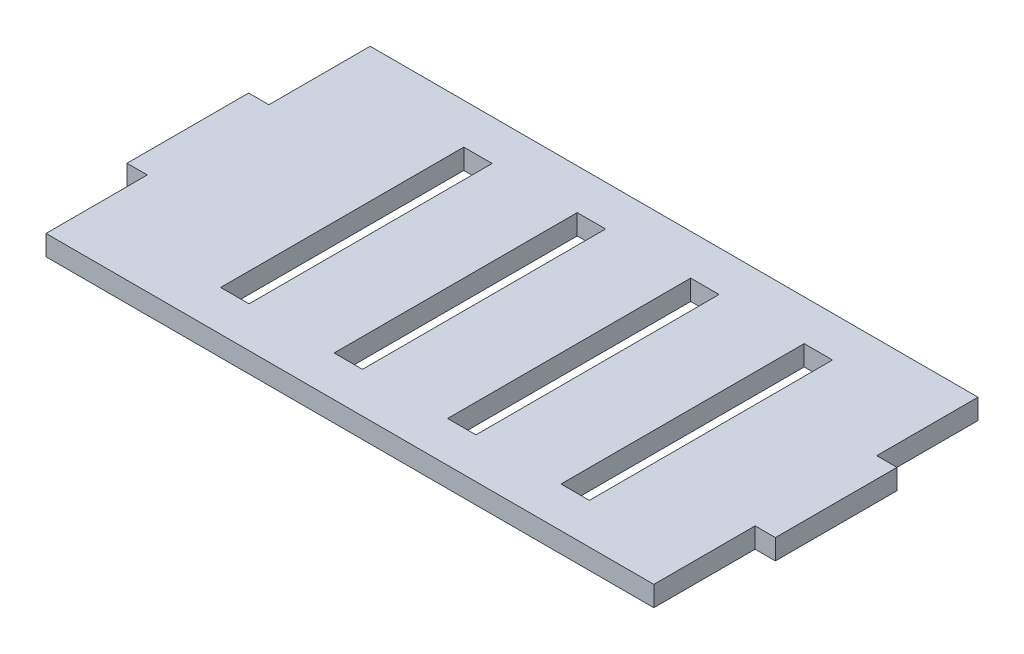
ISO-10303-21;
HEADER;
FILE_DESCRIPTION(('STEP AP214'),'2;1');
FILE_NAME('part.step','',(''),(''),'','','');
FILE_SCHEMA(('AUTOMOTIVE_DESIGN { 1 0 10303 214 1 1 1 1 }'));
ENDSEC;
DATA;
#1=APPLICATION_CONTEXT('core data for automotive mechanical design processes');
#2=APPLICATION_PROTOCOL_DEFINITION('international standard','automotive_design',2000,#1);
#3=PRODUCT_CONTEXT('',#1,'mechanical');
#4=PRODUCT('Part','Part','',(#3));
#5=PRODUCT_RELATED_PRODUCT_CATEGORY('part','',(#4));
#6=PRODUCT_DEFINITION_FORMATION('','',#4);
#7=PRODUCT_DEFINITION_CONTEXT('part definition',#1,'design');
#8=PRODUCT_DEFINITION('design','',#6,#7);
#9=PRODUCT_DEFINITION_SHAPE('','',#8);
#10=(LENGTH_UNIT() NAMED_UNIT(*) SI_UNIT(.MILLI.,.METRE.));
#11=(NAMED_UNIT(*) PLANE_ANGLE_UNIT() SI_UNIT($,.RADIAN.));
#12=(NAMED_UNIT(*) SI_UNIT($,.STERADIAN.) SOLID_ANGLE_UNIT());
#13=UNCERTAINTY_MEASURE_WITH_UNIT(LENGTH_MEASURE(1.E-05),#10,'distance_accuracy_value','');
#14=(GEOMETRIC_REPRESENTATION_CONTEXT(3) GLOBAL_UNCERTAINTY_ASSIGNED_CONTEXT((#13)) GLOBAL_UNIT_ASSIGNED_CONTEXT((#10,
#11,#12)) REPRESENTATION_CONTEXT('',''));
#15=CARTESIAN_POINT('',(0.,0.,0.));
#16=DIRECTION('',(0.,0.,1.));
#17=DIRECTION('',(1.,0.,0.));
#18=AXIS2_PLACEMENT_3D('',#15,#16,#17);
#19=CARTESIAN_POINT('',(95.2499999999999,6.35,50.8));
#20=DIRECTION('',(-1.,0.,0.));
#21=DIRECTION('',(0.,0.,1.));
#22=AXIS2_PLACEMENT_3D('',#19,#20,#21);
#23=PLANE('',#22);
#24=DIRECTION('',(0.,-1.,0.));
#25=VECTOR('',#24,1.);
#26=CARTESIAN_POINT('',(95.2499999999999,6.35,19.05));
#27=LINE('',#26,#25);
#28=CARTESIAN_POINT('',(95.2499999999999,6.35,19.05));
#29=VERTEX_POINT('',#28);
#30=CARTESIAN_POINT('',(95.2499999999999,0.,19.05));
#31=VERTEX_POINT('',#30);
#32=EDGE_CURVE('E49',#29,#31,#27,.T.);
#33=ORIENTED_EDGE('',*,*,#32,.F.);
#34=DIRECTION('',(0.,0.,-1.));
#35=VECTOR('',#34,1.);
#36=CARTESIAN_POINT('',(95.2499999999999,6.35,50.8));
#37=LINE('',#36,#35);
#38=CARTESIAN_POINT('',(95.2499999999999,6.35,50.8));
#39=VERTEX_POINT('',#38);
#40=EDGE_CURVE('E278',#39,#29,#37,.T.);
#41=ORIENTED_EDGE('',*,*,#40,.F.);
#42=DIRECTION('',(0.,-1.,0.));
#43=VECTOR('',#42,1.);
#44=CARTESIAN_POINT('',(95.2499999999999,6.35,50.8));
#45=LINE('',#44,#43);
#46=CARTESIAN_POINT('',(95.2499999999999,0.,50.8));
#47=VERTEX_POINT('',#46);
#48=EDGE_CURVE('E316',#39,#47,#45,.T.);
#49=ORIENTED_EDGE('',*,*,#48,.T.);
#50=DIRECTION('',(0.,0.,-1.));
#51=VECTOR('',#50,1.);
#52=CARTESIAN_POINT('',(95.2499999999999,0.,50.8));
#53=LINE('',#52,#51);
#54=EDGE_CURVE('E349',#47,#31,#53,.T.);
#55=ORIENTED_EDGE('',*,*,#54,.T.);
#56=EDGE_LOOP('',(#33,#41,#49,#55));
#57=FACE_BOUND('',#56,.T.);
#58=ADVANCED_FACE('F33',(#57),#23,.F.);
#59=DIRECTION('',(0.,1.,0.));
#60=VECTOR('',#59,1.);
#61=CARTESIAN_POINT('',(95.2499999999999,6.35,-19.05));
#62=LINE('',#61,#60);
#63=CARTESIAN_POINT('',(95.2499999999999,0.,-19.05));
#64=VERTEX_POINT('',#63);
#65=CARTESIAN_POINT('',(95.2499999999999,6.35,-19.05));
#66=VERTEX_POINT('',#65);
#67=EDGE_CURVE('E57',#64,#66,#62,.T.);
#68=ORIENTED_EDGE('',*,*,#67,.F.);
#69=CARTESIAN_POINT('',(95.2499999999999,0.,-50.8));
#70=VERTEX_POINT('',#69);
#71=EDGE_CURVE('E288',#64,#70,#53,.T.);
#72=ORIENTED_EDGE('',*,*,#71,.T.);
#73=DIRECTION('',(0.,-1.,0.));
#74=VECTOR('',#73,1.);
#75=CARTESIAN_POINT('',(95.2499999999999,6.35,-50.8));
#76=LINE('',#75,#74);
#77=CARTESIAN_POINT('',(95.2499999999999,6.35,-50.8));
#78=VERTEX_POINT('',#77);
#79=EDGE_CURVE('E11',#78,#70,#76,.T.);
#80=ORIENTED_EDGE('',*,*,#79,.F.);
#81=EDGE_CURVE('E267',#66,#78,#37,.T.);
#82=ORIENTED_EDGE('',*,*,#81,.F.);
#83=EDGE_LOOP('',(#68,#72,#80,#82));
#84=FACE_BOUND('',#83,.T.);
#85=ADVANCED_FACE('F348',(#84),#23,.F.);
#86=CARTESIAN_POINT('',(-95.2500000000001,6.35,50.8));
#87=DIRECTION('',(1.,0.,0.));
#88=DIRECTION('',(0.,0.,-1.));
#89=AXIS2_PLACEMENT_3D('',#86,#87,#88);
#90=PLANE('',#89);
#91=DIRECTION('',(0.,-1.,0.));
#92=VECTOR('',#91,1.);
#93=CARTESIAN_POINT('',(-95.2500000000001,6.35,-19.05));
#94=LINE('',#93,#92);
#95=CARTESIAN_POINT('',(-95.2500000000001,6.35,-19.05));
#96=VERTEX_POINT('',#95);
#97=CARTESIAN_POINT('',(-95.2500000000001,0.,-19.05));
#98=VERTEX_POINT('',#97);
#99=EDGE_CURVE('E242',#96,#98,#94,.T.);
#100=ORIENTED_EDGE('',*,*,#99,.F.);
#101=DIRECTION('',(0.,0.,1.));
#102=VECTOR('',#101,1.);
#103=CARTESIAN_POINT('',(-95.2500000000001,6.35,50.8));
#104=LINE('',#103,#102);
#105=CARTESIAN_POINT('',(-95.2500000000001,6.35,-50.8));
#106=VERTEX_POINT('',#105);
#107=EDGE_CURVE('E303',#106,#96,#104,.T.);
#108=ORIENTED_EDGE('',*,*,#107,.F.);
#109=DIRECTION('',(0.,-1.,0.));
#110=VECTOR('',#109,1.);
#111=CARTESIAN_POINT('',(-95.2500000000001,6.35,-50.8));
#112=LINE('',#111,#110);
#113=CARTESIAN_POINT('',(-95.2500000000001,0.,-50.8));
#114=VERTEX_POINT('',#113);
#115=EDGE_CURVE('E41',#106,#114,#112,.T.);
#116=ORIENTED_EDGE('',*,*,#115,.T.);
#117=DIRECTION('',(0.,0.,1.));
#118=VECTOR('',#117,1.);
#119=CARTESIAN_POINT('',(-95.2500000000001,0.,50.8));
#120=LINE('',#119,#118);
#121=EDGE_CURVE('E309',#114,#98,#120,.T.);
#122=ORIENTED_EDGE('',*,*,#121,.T.);
#123=EDGE_LOOP('',(#100,#108,#116,#122));
#124=FACE_BOUND('',#123,.T.);
#125=ADVANCED_FACE('F326',(#124),#90,.F.);
#126=DIRECTION('',(0.,1.,0.));
#127=VECTOR('',#126,1.);
#128=CARTESIAN_POINT('',(-95.2500000000001,6.35,19.05));
#129=LINE('',#128,#127);
#130=CARTESIAN_POINT('',(-95.2500000000001,0.,19.05));
#131=VERTEX_POINT('',#130);
#132=CARTESIAN_POINT('',(-95.2500000000001,6.35,19.05));
#133=VERTEX_POINT('',#132);
#134=EDGE_CURVE('E245',#131,#133,#129,.T.);
#135=ORIENTED_EDGE('',*,*,#134,.F.);
#136=CARTESIAN_POINT('',(-95.2500000000001,0.,50.8));
#137=VERTEX_POINT('',#136);
#138=EDGE_CURVE('E306',#131,#137,#120,.T.);
#139=ORIENTED_EDGE('',*,*,#138,.T.);
#140=DIRECTION('',(0.,-1.,0.));
#141=VECTOR('',#140,1.);
#142=CARTESIAN_POINT('',(-95.2500000000001,6.35,50.8));
#143=LINE('',#142,#141);
#144=CARTESIAN_POINT('',(-95.2500000000001,6.35,50.8));
#145=VERTEX_POINT('',#144);
#146=EDGE_CURVE('E318',#145,#137,#143,.T.);
#147=ORIENTED_EDGE('',*,*,#146,.F.);
#148=EDGE_CURVE('E284',#133,#145,#104,.T.);
#149=ORIENTED_EDGE('',*,*,#148,.F.);
#150=EDGE_LOOP('',(#135,#139,#147,#149));
#151=FACE_BOUND('',#150,.T.);
#152=ADVANCED_FACE('F531',(#151),#90,.F.);
#153=CARTESIAN_POINT('',(-95.2500000000001,6.35,-50.8));
#154=DIRECTION('',(0.,0.,1.));
#155=DIRECTION('',(1.,0.,0.));
#156=AXIS2_PLACEMENT_3D('',#153,#154,#155);
#157=PLANE('',#156);
#158=DIRECTION('',(-1.,0.,0.));
#159=VECTOR('',#158,1.);
#160=CARTESIAN_POINT('',(-95.2500000000001,0.,-50.8));
#161=LINE('',#160,#159);
#162=EDGE_CURVE('E310',#70,#114,#161,.T.);
#163=ORIENTED_EDGE('',*,*,#162,.T.);
#164=ORIENTED_EDGE('',*,*,#115,.F.);
#165=DIRECTION('',(-1.,0.,0.));
#166=VECTOR('',#165,1.);
#167=CARTESIAN_POINT('',(-95.2500000000001,6.35,-50.8));
#168=LINE('',#167,#166);
#169=EDGE_CURVE('E283',#78,#106,#168,.T.);
#170=ORIENTED_EDGE('',*,*,#169,.F.);
#171=ORIENTED_EDGE('',*,*,#79,.T.);
#172=EDGE_LOOP('',(#163,#164,#170,#171));
#173=FACE_BOUND('',#172,.T.);
#174=ADVANCED_FACE('F347',(#173),#157,.F.);
#175=CARTESIAN_POINT('',(-95.2500000000001,6.35,50.8));
#176=DIRECTION('',(0.,0.,-1.));
#177=DIRECTION('',(-1.,0.,0.));
#178=AXIS2_PLACEMENT_3D('',#175,#176,#177);
#179=PLANE('',#178);
#180=DIRECTION('',(1.,0.,0.));
#181=VECTOR('',#180,1.);
#182=CARTESIAN_POINT('',(-95.2500000000001,0.,50.8));
#183=LINE('',#182,#181);
#184=EDGE_CURVE('E286',#137,#47,#183,.T.);
#185=ORIENTED_EDGE('',*,*,#184,.T.);
#186=ORIENTED_EDGE('',*,*,#48,.F.);
#187=DIRECTION('',(1.,0.,0.));
#188=VECTOR('',#187,1.);
#189=CARTESIAN_POINT('',(-95.2500000000001,6.35,50.8));
#190=LINE('',#189,#188);
#191=EDGE_CURVE('E280',#145,#39,#190,.T.);
#192=ORIENTED_EDGE('',*,*,#191,.F.);
#193=ORIENTED_EDGE('',*,*,#146,.T.);
#194=EDGE_LOOP('',(#185,#186,#192,#193));
#195=FACE_BOUND('',#194,.T.);
#196=ADVANCED_FACE('F538',(#195),#179,.F.);
#197=CARTESIAN_POINT('',(0.,6.35,0.));
#198=DIRECTION('',(0.,-1.,0.));
#199=DIRECTION('',(0.,0.,-1.));
#200=AXIS2_PLACEMENT_3D('',#197,#198,#199);
#201=PLANE('',#200);
#202=DIRECTION('',(-1.,0.,0.));
#203=VECTOR('',#202,1.);
#204=CARTESIAN_POINT('',(53.4669999999999,6.35,-38.1));
#205=LINE('',#204,#203);
#206=CARTESIAN_POINT('',(62.3569999999999,6.35,-38.1));
#207=VERTEX_POINT('',#206);
#208=CARTESIAN_POINT('',(53.4669999999999,6.35,-38.1));
#209=VERTEX_POINT('',#208);
#210=EDGE_CURVE('E474',#207,#209,#205,.T.);
#211=ORIENTED_EDGE('',*,*,#210,.F.);
#212=DIRECTION('',(0.,0.,-1.));
#213=VECTOR('',#212,1.);
#214=CARTESIAN_POINT('',(62.3569999999999,6.35,-38.1));
#215=LINE('',#214,#213);
#216=CARTESIAN_POINT('',(62.3569999999999,6.35,38.1));
#217=VERTEX_POINT('',#216);
#218=EDGE_CURVE('E338',#217,#207,#215,.T.);
#219=ORIENTED_EDGE('',*,*,#218,.F.);
#220=DIRECTION('',(1.,0.,0.));
#221=VECTOR('',#220,1.);
#222=CARTESIAN_POINT('',(53.4669999999999,6.35,38.1));
#223=LINE('',#222,#221);
#224=CARTESIAN_POINT('',(53.4669999999999,6.35,38.1));
#225=VERTEX_POINT('',#224);
#226=EDGE_CURVE('E467',#225,#217,#223,.T.);
#227=ORIENTED_EDGE('',*,*,#226,.F.);
#228=DIRECTION('',(0.,0.,1.));
#229=VECTOR('',#228,1.);
#230=CARTESIAN_POINT('',(53.4669999999999,6.35,-38.1));
#231=LINE('',#230,#229);
#232=EDGE_CURVE('E471',#209,#225,#231,.T.);
#233=ORIENTED_EDGE('',*,*,#232,.F.);
#234=EDGE_LOOP('',(#211,#219,#227,#233));
#235=FACE_BOUND('',#234,.T.);
#236=DIRECTION('',(-1.,0.,0.));
#237=VECTOR('',#236,1.);
#238=CARTESIAN_POINT('',(17.9069999999999,6.35,-38.1));
#239=LINE('',#238,#237);
#240=CARTESIAN_POINT('',(26.7969999999999,6.35,-38.1));
#241=VERTEX_POINT('',#240);
#242=CARTESIAN_POINT('',(17.9069999999999,6.35,-38.1));
#243=VERTEX_POINT('',#242);
#244=EDGE_CURVE('E442',#241,#243,#239,.T.);
#245=ORIENTED_EDGE('',*,*,#244,.F.);
#246=DIRECTION('',(0.,0.,-1.));
#247=VECTOR('',#246,1.);
#248=CARTESIAN_POINT('',(26.7969999999999,6.35,-38.1));
#249=LINE('',#248,#247);
#250=CARTESIAN_POINT('',(26.7969999999999,6.35,38.1));
#251=VERTEX_POINT('',#250);
#252=EDGE_CURVE('E445',#251,#241,#249,.T.);
#253=ORIENTED_EDGE('',*,*,#252,.F.);
#254=DIRECTION('',(1.,0.,0.));
#255=VECTOR('',#254,1.);
#256=CARTESIAN_POINT('',(17.9069999999999,6.35,38.1));
#257=LINE('',#256,#255);
#258=CARTESIAN_POINT('',(17.9069999999999,6.35,38.1));
#259=VERTEX_POINT('',#258);
#260=EDGE_CURVE('E435',#259,#251,#257,.T.);
#261=ORIENTED_EDGE('',*,*,#260,.F.);
#262=DIRECTION('',(0.,0.,1.));
#263=VECTOR('',#262,1.);
#264=CARTESIAN_POINT('',(17.9069999999999,6.35,-38.1));
#265=LINE('',#264,#263);
#266=EDGE_CURVE('E439',#243,#259,#265,.T.);
#267=ORIENTED_EDGE('',*,*,#266,.F.);
#268=EDGE_LOOP('',(#245,#253,#261,#267));
#269=FACE_BOUND('',#268,.T.);
#270=DIRECTION('',(-1.,0.,0.));
#271=VECTOR('',#270,1.);
#272=CARTESIAN_POINT('',(-17.6530000000001,6.35,-38.1));
#273=LINE('',#272,#271);
#274=CARTESIAN_POINT('',(-8.76300000000006,6.35,-38.1));
#275=VERTEX_POINT('',#274);
#276=CARTESIAN_POINT('',(-17.6530000000001,6.35,-38.1));
#277=VERTEX_POINT('',#276);
#278=EDGE_CURVE('E410',#275,#277,#273,.T.);
#279=ORIENTED_EDGE('',*,*,#278,.F.);
#280=DIRECTION('',(0.,0.,-1.));
#281=VECTOR('',#280,1.);
#282=CARTESIAN_POINT('',(-8.76300000000006,6.35,-38.1));
#283=LINE('',#282,#281);
#284=CARTESIAN_POINT('',(-8.76300000000005,6.35,38.1));
#285=VERTEX_POINT('',#284);
#286=EDGE_CURVE('E413',#285,#275,#283,.T.);
#287=ORIENTED_EDGE('',*,*,#286,.F.);
#288=DIRECTION('',(1.,0.,0.));
#289=VECTOR('',#288,1.);
#290=CARTESIAN_POINT('',(-17.6530000000001,6.35,38.1));
#291=LINE('',#290,#289);
#292=CARTESIAN_POINT('',(-17.6530000000001,6.35,38.1));
#293=VERTEX_POINT('',#292);
#294=EDGE_CURVE('E403',#293,#285,#291,.T.);
#295=ORIENTED_EDGE('',*,*,#294,.F.);
#296=DIRECTION('',(0.,0.,1.));
#297=VECTOR('',#296,1.);
#298=CARTESIAN_POINT('',(-17.6530000000001,6.35,-38.1));
#299=LINE('',#298,#297);
#300=EDGE_CURVE('E407',#277,#293,#299,.T.);
#301=ORIENTED_EDGE('',*,*,#300,.F.);
#302=EDGE_LOOP('',(#279,#287,#295,#301));
#303=FACE_BOUND('',#302,.T.);
#304=DIRECTION('',(-1.,0.,0.));
#305=VECTOR('',#304,1.);
#306=CARTESIAN_POINT('',(-53.2130000000001,6.35,-38.1));
#307=LINE('',#306,#305);
#308=CARTESIAN_POINT('',(-44.3230000000001,6.35,-38.1));
#309=VERTEX_POINT('',#308);
#310=CARTESIAN_POINT('',(-53.2130000000001,6.35,-38.1));
#311=VERTEX_POINT('',#310);
#312=EDGE_CURVE('E383',#309,#311,#307,.T.);
#313=ORIENTED_EDGE('',*,*,#312,.F.);
#314=DIRECTION('',(0.,0.,-1.));
#315=VECTOR('',#314,1.);
#316=CARTESIAN_POINT('',(-44.3230000000001,6.35,-38.1));
#317=LINE('',#316,#315);
#318=CARTESIAN_POINT('',(-44.3230000000001,6.35,38.1));
#319=VERTEX_POINT('',#318);
#320=EDGE_CURVE('E381',#319,#309,#317,.T.);
#321=ORIENTED_EDGE('',*,*,#320,.F.);
#322=DIRECTION('',(1.,0.,0.));
#323=VECTOR('',#322,1.);
#324=CARTESIAN_POINT('',(-53.2130000000001,6.35,38.1));
#325=LINE('',#324,#323);
#326=CARTESIAN_POINT('',(-53.2130000000001,6.35,38.1));
#327=VERTEX_POINT('',#326);
#328=EDGE_CURVE('E359',#327,#319,#325,.T.);
#329=ORIENTED_EDGE('',*,*,#328,.F.);
#330=DIRECTION('',(0.,0.,1.));
#331=VECTOR('',#330,1.);
#332=CARTESIAN_POINT('',(-53.2130000000001,6.35,-38.1));
#333=LINE('',#332,#331);
#334=EDGE_CURVE('E385',#311,#327,#333,.T.);
#335=ORIENTED_EDGE('',*,*,#334,.F.);
#336=EDGE_LOOP('',(#313,#321,#329,#335));
#337=FACE_BOUND('',#336,.T.);
#338=ORIENTED_EDGE('',*,*,#40,.T.);
#339=DIRECTION('',(-1.,0.,0.));
#340=VECTOR('',#339,1.);
#341=CARTESIAN_POINT('',(101.6,6.35,19.05));
#342=LINE('',#341,#340);
#343=CARTESIAN_POINT('',(101.6,6.35,19.05));
#344=VERTEX_POINT('',#343);
#345=EDGE_CURVE('E255',#344,#29,#342,.T.);
#346=ORIENTED_EDGE('',*,*,#345,.F.);
#347=DIRECTION('',(0.,0.,1.));
#348=VECTOR('',#347,1.);
#349=CARTESIAN_POINT('',(101.6,6.35,19.05));
#350=LINE('',#349,#348);
#351=CARTESIAN_POINT('',(101.6,6.35,-19.05));
#352=VERTEX_POINT('',#351);
#353=EDGE_CURVE('E236',#352,#344,#350,.T.);
#354=ORIENTED_EDGE('',*,*,#353,.F.);
#355=DIRECTION('',(-1.,0.,0.));
#356=VECTOR('',#355,1.);
#357=CARTESIAN_POINT('',(101.6,6.35,-19.05));
#358=LINE('',#357,#356);
#359=EDGE_CURVE('E247',#352,#66,#358,.T.);
#360=ORIENTED_EDGE('',*,*,#359,.T.);
#361=ORIENTED_EDGE('',*,*,#81,.T.);
#362=ORIENTED_EDGE('',*,*,#169,.T.);
#363=ORIENTED_EDGE('',*,*,#107,.T.);
#364=DIRECTION('',(1.,0.,0.));
#365=VECTOR('',#364,1.);
#366=CARTESIAN_POINT('',(-101.6,6.35,-19.05));
#367=LINE('',#366,#365);
#368=CARTESIAN_POINT('',(-101.6,6.35,-19.05));
#369=VERTEX_POINT('',#368);
#370=EDGE_CURVE('E344',#369,#96,#367,.T.);
#371=ORIENTED_EDGE('',*,*,#370,.F.);
#372=DIRECTION('',(0.,0.,-1.));
#373=VECTOR('',#372,1.);
#374=CARTESIAN_POINT('',(-101.6,6.35,-19.05));
#375=LINE('',#374,#373);
#376=CARTESIAN_POINT('',(-101.6,6.35,19.05));
#377=VERTEX_POINT('',#376);
#378=EDGE_CURVE('E506',#377,#369,#375,.T.);
#379=ORIENTED_EDGE('',*,*,#378,.F.);
#380=DIRECTION('',(1.,0.,0.));
#381=VECTOR('',#380,1.);
#382=CARTESIAN_POINT('',(-101.6,6.35,19.05));
#383=LINE('',#382,#381);
#384=EDGE_CURVE('E494',#377,#133,#383,.T.);
#385=ORIENTED_EDGE('',*,*,#384,.T.);
#386=ORIENTED_EDGE('',*,*,#148,.T.);
#387=ORIENTED_EDGE('',*,*,#191,.T.);
#388=EDGE_LOOP('',(#338,#346,#354,#360,#361,#362,#363,#371,#379,#385,#386,#387));
#389=FACE_BOUND('',#388,.T.);
#390=ADVANCED_FACE('F277',(#235,#269,#303,#337,#389),#201,.F.);
#391=CARTESIAN_POINT('',(0.,0.,0.));
#392=DIRECTION('',(0.,-1.,0.));
#393=DIRECTION('',(0.,0.,-1.));
#394=AXIS2_PLACEMENT_3D('',#391,#392,#393);
#395=PLANE('',#394);
#396=DIRECTION('',(0.,0.,-1.));
#397=VECTOR('',#396,1.);
#398=CARTESIAN_POINT('',(62.3569999999999,0.,-38.1));
#399=LINE('',#398,#397);
#400=CARTESIAN_POINT('',(62.3569999999999,0.,38.1));
#401=VERTEX_POINT('',#400);
#402=CARTESIAN_POINT('',(62.3569999999999,0.,-38.1));
#403=VERTEX_POINT('',#402);
#404=EDGE_CURVE('E470',#401,#403,#399,.T.);
#405=ORIENTED_EDGE('',*,*,#404,.T.);
#406=DIRECTION('',(-1.,0.,0.));
#407=VECTOR('',#406,1.);
#408=CARTESIAN_POINT('',(53.4669999999999,0.,-38.1));
#409=LINE('',#408,#407);
#410=CARTESIAN_POINT('',(53.4669999999999,0.,-38.1));
#411=VERTEX_POINT('',#410);
#412=EDGE_CURVE('E483',#403,#411,#409,.T.);
#413=ORIENTED_EDGE('',*,*,#412,.T.);
#414=DIRECTION('',(0.,0.,1.));
#415=VECTOR('',#414,1.);
#416=CARTESIAN_POINT('',(53.4669999999999,0.,-38.1));
#417=LINE('',#416,#415);
#418=CARTESIAN_POINT('',(53.4669999999999,0.,38.1));
#419=VERTEX_POINT('',#418);
#420=EDGE_CURVE('E480',#411,#419,#417,.T.);
#421=ORIENTED_EDGE('',*,*,#420,.T.);
#422=DIRECTION('',(1.,0.,0.));
#423=VECTOR('',#422,1.);
#424=CARTESIAN_POINT('',(53.4669999999999,0.,38.1));
#425=LINE('',#424,#423);
#426=EDGE_CURVE('E462',#419,#401,#425,.T.);
#427=ORIENTED_EDGE('',*,*,#426,.T.);
#428=EDGE_LOOP('',(#405,#413,#421,#427));
#429=FACE_BOUND('',#428,.T.);
#430=DIRECTION('',(0.,0.,-1.));
#431=VECTOR('',#430,1.);
#432=CARTESIAN_POINT('',(26.7969999999999,0.,-38.1));
#433=LINE('',#432,#431);
#434=CARTESIAN_POINT('',(26.7969999999999,0.,38.1));
#435=VERTEX_POINT('',#434);
#436=CARTESIAN_POINT('',(26.7969999999999,0.,-38.1));
#437=VERTEX_POINT('',#436);
#438=EDGE_CURVE('E438',#435,#437,#433,.T.);
#439=ORIENTED_EDGE('',*,*,#438,.T.);
#440=DIRECTION('',(-1.,0.,0.));
#441=VECTOR('',#440,1.);
#442=CARTESIAN_POINT('',(17.9069999999999,0.,-38.1));
#443=LINE('',#442,#441);
#444=CARTESIAN_POINT('',(17.9069999999999,0.,-38.1));
#445=VERTEX_POINT('',#444);
#446=EDGE_CURVE('E453',#437,#445,#443,.T.);
#447=ORIENTED_EDGE('',*,*,#446,.T.);
#448=DIRECTION('',(0.,0.,1.));
#449=VECTOR('',#448,1.);
#450=CARTESIAN_POINT('',(17.9069999999999,0.,-38.1));
#451=LINE('',#450,#449);
#452=CARTESIAN_POINT('',(17.9069999999999,0.,38.1));
#453=VERTEX_POINT('',#452);
#454=EDGE_CURVE('E450',#445,#453,#451,.T.);
#455=ORIENTED_EDGE('',*,*,#454,.T.);
#456=DIRECTION('',(1.,0.,0.));
#457=VECTOR('',#456,1.);
#458=CARTESIAN_POINT('',(17.9069999999999,0.,38.1));
#459=LINE('',#458,#457);
#460=EDGE_CURVE('E430',#453,#435,#459,.T.);
#461=ORIENTED_EDGE('',*,*,#460,.T.);
#462=EDGE_LOOP('',(#439,#447,#455,#461));
#463=FACE_BOUND('',#462,.T.);
#464=DIRECTION('',(0.,0.,-1.));
#465=VECTOR('',#464,1.);
#466=CARTESIAN_POINT('',(-8.76300000000006,0.,-38.1));
#467=LINE('',#466,#465);
#468=CARTESIAN_POINT('',(-8.76300000000005,0.,38.1));
#469=VERTEX_POINT('',#468);
#470=CARTESIAN_POINT('',(-8.76300000000006,0.,-38.1));
#471=VERTEX_POINT('',#470);
#472=EDGE_CURVE('E406',#469,#471,#467,.T.);
#473=ORIENTED_EDGE('',*,*,#472,.T.);
#474=DIRECTION('',(-1.,0.,0.));
#475=VECTOR('',#474,1.);
#476=CARTESIAN_POINT('',(-17.6530000000001,0.,-38.1));
#477=LINE('',#476,#475);
#478=CARTESIAN_POINT('',(-17.6530000000001,0.,-38.1));
#479=VERTEX_POINT('',#478);
#480=EDGE_CURVE('E421',#471,#479,#477,.T.);
#481=ORIENTED_EDGE('',*,*,#480,.T.);
#482=DIRECTION('',(0.,0.,1.));
#483=VECTOR('',#482,1.);
#484=CARTESIAN_POINT('',(-17.6530000000001,0.,-38.1));
#485=LINE('',#484,#483);
#486=CARTESIAN_POINT('',(-17.6530000000001,0.,38.1));
#487=VERTEX_POINT('',#486);
#488=EDGE_CURVE('E418',#479,#487,#485,.T.);
#489=ORIENTED_EDGE('',*,*,#488,.T.);
#490=DIRECTION('',(1.,0.,0.));
#491=VECTOR('',#490,1.);
#492=CARTESIAN_POINT('',(-17.6530000000001,0.,38.1));
#493=LINE('',#492,#491);
#494=EDGE_CURVE('E398',#487,#469,#493,.T.);
#495=ORIENTED_EDGE('',*,*,#494,.T.);
#496=EDGE_LOOP('',(#473,#481,#489,#495));
#497=FACE_BOUND('',#496,.T.);
#498=DIRECTION('',(0.,0.,-1.));
#499=VECTOR('',#498,1.);
#500=CARTESIAN_POINT('',(-44.3230000000001,0.,-38.1));
#501=LINE('',#500,#499);
#502=CARTESIAN_POINT('',(-44.3230000000001,0.,38.1));
#503=VERTEX_POINT('',#502);
#504=CARTESIAN_POINT('',(-44.3230000000001,0.,-38.1));
#505=VERTEX_POINT('',#504);
#506=EDGE_CURVE('E388',#503,#505,#501,.T.);
#507=ORIENTED_EDGE('',*,*,#506,.T.);
#508=DIRECTION('',(-1.,0.,0.));
#509=VECTOR('',#508,1.);
#510=CARTESIAN_POINT('',(-53.2130000000001,0.,-38.1));
#511=LINE('',#510,#509);
#512=CARTESIAN_POINT('',(-53.2130000000001,0.,-38.1));
#513=VERTEX_POINT('',#512);
#514=EDGE_CURVE('E377',#505,#513,#511,.T.);
#515=ORIENTED_EDGE('',*,*,#514,.T.);
#516=DIRECTION('',(0.,0.,1.));
#517=VECTOR('',#516,1.);
#518=CARTESIAN_POINT('',(-53.2130000000001,0.,-38.1));
#519=LINE('',#518,#517);
#520=CARTESIAN_POINT('',(-53.2130000000001,0.,38.1));
#521=VERTEX_POINT('',#520);
#522=EDGE_CURVE('E371',#513,#521,#519,.T.);
#523=ORIENTED_EDGE('',*,*,#522,.T.);
#524=DIRECTION('',(1.,0.,0.));
#525=VECTOR('',#524,1.);
#526=CARTESIAN_POINT('',(-53.2130000000001,0.,38.1));
#527=LINE('',#526,#525);
#528=EDGE_CURVE('E366',#521,#503,#527,.T.);
#529=ORIENTED_EDGE('',*,*,#528,.T.);
#530=EDGE_LOOP('',(#507,#515,#523,#529));
#531=FACE_BOUND('',#530,.T.);
#532=ORIENTED_EDGE('',*,*,#54,.F.);
#533=ORIENTED_EDGE('',*,*,#184,.F.);
#534=ORIENTED_EDGE('',*,*,#138,.F.);
#535=DIRECTION('',(1.,0.,0.));
#536=VECTOR('',#535,1.);
#537=CARTESIAN_POINT('',(-101.6,0.,19.05));
#538=LINE('',#537,#536);
#539=CARTESIAN_POINT('',(-101.6,0.,19.05));
#540=VERTEX_POINT('',#539);
#541=EDGE_CURVE('E339',#540,#131,#538,.T.);
#542=ORIENTED_EDGE('',*,*,#541,.F.);
#543=DIRECTION('',(0.,0.,1.));
#544=VECTOR('',#543,1.);
#545=CARTESIAN_POINT('',(-101.6,0.,-19.05));
#546=LINE('',#545,#544);
#547=CARTESIAN_POINT('',(-101.6,0.,-19.05));
#548=VERTEX_POINT('',#547);
#549=EDGE_CURVE('E334',#548,#540,#546,.T.);
#550=ORIENTED_EDGE('',*,*,#549,.F.);
#551=DIRECTION('',(1.,0.,0.));
#552=VECTOR('',#551,1.);
#553=CARTESIAN_POINT('',(-101.6,0.,-19.05));
#554=LINE('',#553,#552);
#555=EDGE_CURVE('E332',#548,#98,#554,.T.);
#556=ORIENTED_EDGE('',*,*,#555,.T.);
#557=ORIENTED_EDGE('',*,*,#121,.F.);
#558=ORIENTED_EDGE('',*,*,#162,.F.);
#559=ORIENTED_EDGE('',*,*,#71,.F.);
#560=DIRECTION('',(-1.,0.,0.));
#561=VECTOR('',#560,1.);
#562=CARTESIAN_POINT('',(101.6,0.,-19.05));
#563=LINE('',#562,#561);
#564=CARTESIAN_POINT('',(101.6,0.,-19.05));
#565=VERTEX_POINT('',#564);
#566=EDGE_CURVE('E227',#565,#64,#563,.T.);
#567=ORIENTED_EDGE('',*,*,#566,.F.);
#568=DIRECTION('',(0.,0.,-1.));
#569=VECTOR('',#568,1.);
#570=CARTESIAN_POINT('',(101.6,0.,19.05));
#571=LINE('',#570,#569);
#572=CARTESIAN_POINT('',(101.6,0.,19.05));
#573=VERTEX_POINT('',#572);
#574=EDGE_CURVE('E220',#573,#565,#571,.T.);
#575=ORIENTED_EDGE('',*,*,#574,.F.);
#576=DIRECTION('',(-1.,0.,0.));
#577=VECTOR('',#576,1.);
#578=CARTESIAN_POINT('',(101.6,0.,19.05));
#579=LINE('',#578,#577);
#580=EDGE_CURVE('E225',#573,#31,#579,.T.);
#581=ORIENTED_EDGE('',*,*,#580,.T.);
#582=EDGE_LOOP('',(#532,#533,#534,#542,#550,#556,#557,#558,#559,#567,#575,#581));
#583=FACE_BOUND('',#582,.T.);
#584=ADVANCED_FACE('F223',(#429,#463,#497,#531,#583),#395,.T.);
#585=CARTESIAN_POINT('',(-44.3230000000001,0.,-38.1));
#586=DIRECTION('',(1.,0.,0.));
#587=DIRECTION('',(0.,0.,-1.));
#588=AXIS2_PLACEMENT_3D('',#585,#586,#587);
#589=PLANE('',#588);
#590=ORIENTED_EDGE('',*,*,#320,.T.);
#591=DIRECTION('',(0.,1.,0.));
#592=VECTOR('',#591,1.);
#593=CARTESIAN_POINT('',(-44.3230000000001,0.,-38.1));
#594=LINE('',#593,#592);
#595=EDGE_CURVE('E293',#505,#309,#594,.T.);
#596=ORIENTED_EDGE('',*,*,#595,.F.);
#597=ORIENTED_EDGE('',*,*,#506,.F.);
#598=DIRECTION('',(0.,1.,0.));
#599=VECTOR('',#598,1.);
#600=CARTESIAN_POINT('',(-44.3230000000001,0.,38.1));
#601=LINE('',#600,#599);
#602=EDGE_CURVE('E350',#503,#319,#601,.T.);
#603=ORIENTED_EDGE('',*,*,#602,.T.);
#604=EDGE_LOOP('',(#590,#596,#597,#603));
#605=FACE_BOUND('',#604,.T.);
#606=ADVANCED_FACE('F558',(#605),#589,.F.);
#607=CARTESIAN_POINT('',(-53.2130000000001,0.,38.1));
#608=DIRECTION('',(0.,0.,1.));
#609=DIRECTION('',(1.,0.,0.));
#610=AXIS2_PLACEMENT_3D('',#607,#608,#609);
#611=PLANE('',#610);
#612=ORIENTED_EDGE('',*,*,#328,.T.);
#613=ORIENTED_EDGE('',*,*,#602,.F.);
#614=ORIENTED_EDGE('',*,*,#528,.F.);
#615=DIRECTION('',(0.,1.,0.));
#616=VECTOR('',#615,1.);
#617=CARTESIAN_POINT('',(-53.2130000000001,0.,38.1));
#618=LINE('',#617,#616);
#619=EDGE_CURVE('E351',#521,#327,#618,.T.);
#620=ORIENTED_EDGE('',*,*,#619,.T.);
#621=EDGE_LOOP('',(#612,#613,#614,#620));
#622=FACE_BOUND('',#621,.T.);
#623=ADVANCED_FACE('F565',(#622),#611,.F.);
#624=CARTESIAN_POINT('',(-53.2130000000001,0.,-38.1));
#625=DIRECTION('',(-1.,0.,0.));
#626=DIRECTION('',(0.,0.,1.));
#627=AXIS2_PLACEMENT_3D('',#624,#625,#626);
#628=PLANE('',#627);
#629=ORIENTED_EDGE('',*,*,#334,.T.);
#630=ORIENTED_EDGE('',*,*,#619,.F.);
#631=ORIENTED_EDGE('',*,*,#522,.F.);
#632=DIRECTION('',(0.,1.,0.));
#633=VECTOR('',#632,1.);
#634=CARTESIAN_POINT('',(-53.2130000000001,0.,-38.1));
#635=LINE('',#634,#633);
#636=EDGE_CURVE('E356',#513,#311,#635,.T.);
#637=ORIENTED_EDGE('',*,*,#636,.T.);
#638=EDGE_LOOP('',(#629,#630,#631,#637));
#639=FACE_BOUND('',#638,.T.);
#640=ADVANCED_FACE('F570',(#639),#628,.F.);
#641=CARTESIAN_POINT('',(-53.2130000000001,0.,-38.1));
#642=DIRECTION('',(0.,0.,-1.));
#643=DIRECTION('',(-1.,0.,0.));
#644=AXIS2_PLACEMENT_3D('',#641,#642,#643);
#645=PLANE('',#644);
#646=ORIENTED_EDGE('',*,*,#312,.T.);
#647=ORIENTED_EDGE('',*,*,#636,.F.);
#648=ORIENTED_EDGE('',*,*,#514,.F.);
#649=ORIENTED_EDGE('',*,*,#595,.T.);
#650=EDGE_LOOP('',(#646,#647,#648,#649));
#651=FACE_BOUND('',#650,.T.);
#652=ADVANCED_FACE('F566',(#651),#645,.F.);
#653=CARTESIAN_POINT('',(-8.76300000000006,0.,-38.1));
#654=DIRECTION('',(1.,0.,0.));
#655=DIRECTION('',(0.,0.,-1.));
#656=AXIS2_PLACEMENT_3D('',#653,#654,#655);
#657=PLANE('',#656);
#658=ORIENTED_EDGE('',*,*,#286,.T.);
#659=DIRECTION('',(0.,1.,0.));
#660=VECTOR('',#659,1.);
#661=CARTESIAN_POINT('',(-8.76300000000006,0.,-38.1));
#662=LINE('',#661,#660);
#663=EDGE_CURVE('E394',#471,#275,#662,.T.);
#664=ORIENTED_EDGE('',*,*,#663,.F.);
#665=ORIENTED_EDGE('',*,*,#472,.F.);
#666=DIRECTION('',(0.,1.,0.));
#667=VECTOR('',#666,1.);
#668=CARTESIAN_POINT('',(-8.76300000000005,0.,38.1));
#669=LINE('',#668,#667);
#670=EDGE_CURVE('E384',#469,#285,#669,.T.);
#671=ORIENTED_EDGE('',*,*,#670,.T.);
#672=EDGE_LOOP('',(#658,#664,#665,#671));
#673=FACE_BOUND('',#672,.T.);
#674=ADVANCED_FACE('F569',(#673),#657,.F.);
#675=CARTESIAN_POINT('',(-17.6530000000001,0.,38.1));
#676=DIRECTION('',(0.,0.,1.));
#677=DIRECTION('',(1.,0.,0.));
#678=AXIS2_PLACEMENT_3D('',#675,#676,#677);
#679=PLANE('',#678);
#680=ORIENTED_EDGE('',*,*,#294,.T.);
#681=ORIENTED_EDGE('',*,*,#670,.F.);
#682=ORIENTED_EDGE('',*,*,#494,.F.);
#683=DIRECTION('',(0.,1.,0.));
#684=VECTOR('',#683,1.);
#685=CARTESIAN_POINT('',(-17.6530000000001,0.,38.1));
#686=LINE('',#685,#684);
#687=EDGE_CURVE('E400',#487,#293,#686,.T.);
#688=ORIENTED_EDGE('',*,*,#687,.T.);
#689=EDGE_LOOP('',(#680,#681,#682,#688));
#690=FACE_BOUND('',#689,.T.);
#691=ADVANCED_FACE('F577',(#690),#679,.F.);
#692=CARTESIAN_POINT('',(-17.6530000000001,0.,-38.1));
#693=DIRECTION('',(-1.,0.,0.));
#694=DIRECTION('',(0.,0.,1.));
#695=AXIS2_PLACEMENT_3D('',#692,#693,#694);
#696=PLANE('',#695);
#697=ORIENTED_EDGE('',*,*,#300,.T.);
#698=ORIENTED_EDGE('',*,*,#687,.F.);
#699=ORIENTED_EDGE('',*,*,#488,.F.);
#700=DIRECTION('',(0.,1.,0.));
#701=VECTOR('',#700,1.);
#702=CARTESIAN_POINT('',(-17.6530000000001,0.,-38.1));
#703=LINE('',#702,#701);
#704=EDGE_CURVE('E397',#479,#277,#703,.T.);
#705=ORIENTED_EDGE('',*,*,#704,.T.);
#706=EDGE_LOOP('',(#697,#698,#699,#705));
#707=FACE_BOUND('',#706,.T.);
#708=ADVANCED_FACE('F583',(#707),#696,.F.);
#709=CARTESIAN_POINT('',(-17.6530000000001,0.,-38.1));
#710=DIRECTION('',(0.,0.,-1.));
#711=DIRECTION('',(-1.,0.,0.));
#712=AXIS2_PLACEMENT_3D('',#709,#710,#711);
#713=PLANE('',#712);
#714=ORIENTED_EDGE('',*,*,#278,.T.);
#715=ORIENTED_EDGE('',*,*,#704,.F.);
#716=ORIENTED_EDGE('',*,*,#480,.F.);
#717=ORIENTED_EDGE('',*,*,#663,.T.);
#718=EDGE_LOOP('',(#714,#715,#716,#717));
#719=FACE_BOUND('',#718,.T.);
#720=ADVANCED_FACE('F579',(#719),#713,.F.);
#721=CARTESIAN_POINT('',(26.7969999999999,0.,-38.1));
#722=DIRECTION('',(1.,0.,0.));
#723=DIRECTION('',(0.,0.,-1.));
#724=AXIS2_PLACEMENT_3D('',#721,#722,#723);
#725=PLANE('',#724);
#726=ORIENTED_EDGE('',*,*,#252,.T.);
#727=DIRECTION('',(0.,1.,0.));
#728=VECTOR('',#727,1.);
#729=CARTESIAN_POINT('',(26.7969999999999,0.,-38.1));
#730=LINE('',#729,#728);
#731=EDGE_CURVE('E426',#437,#241,#730,.T.);
#732=ORIENTED_EDGE('',*,*,#731,.F.);
#733=ORIENTED_EDGE('',*,*,#438,.F.);
#734=DIRECTION('',(0.,1.,0.));
#735=VECTOR('',#734,1.);
#736=CARTESIAN_POINT('',(26.7969999999999,0.,38.1));
#737=LINE('',#736,#735);
#738=EDGE_CURVE('E415',#435,#251,#737,.T.);
#739=ORIENTED_EDGE('',*,*,#738,.T.);
#740=EDGE_LOOP('',(#726,#732,#733,#739));
#741=FACE_BOUND('',#740,.T.);
#742=ADVANCED_FACE('F582',(#741),#725,.F.);
#743=CARTESIAN_POINT('',(17.9069999999999,0.,38.1));
#744=DIRECTION('',(0.,0.,1.));
#745=DIRECTION('',(1.,0.,0.));
#746=AXIS2_PLACEMENT_3D('',#743,#744,#745);
#747=PLANE('',#746);
#748=ORIENTED_EDGE('',*,*,#260,.T.);
#749=ORIENTED_EDGE('',*,*,#738,.F.);
#750=ORIENTED_EDGE('',*,*,#460,.F.);
#751=DIRECTION('',(0.,1.,0.));
#752=VECTOR('',#751,1.);
#753=CARTESIAN_POINT('',(17.9069999999999,0.,38.1));
#754=LINE('',#753,#752);
#755=EDGE_CURVE('E432',#453,#259,#754,.T.);
#756=ORIENTED_EDGE('',*,*,#755,.T.);
#757=EDGE_LOOP('',(#748,#749,#750,#756));
#758=FACE_BOUND('',#757,.T.);
#759=ADVANCED_FACE('F593',(#758),#747,.F.);
#760=CARTESIAN_POINT('',(17.9069999999999,0.,-38.1));
#761=DIRECTION('',(-1.,0.,0.));
#762=DIRECTION('',(0.,0.,1.));
#763=AXIS2_PLACEMENT_3D('',#760,#761,#762);
#764=PLANE('',#763);
#765=ORIENTED_EDGE('',*,*,#266,.T.);
#766=ORIENTED_EDGE('',*,*,#755,.F.);
#767=ORIENTED_EDGE('',*,*,#454,.F.);
#768=DIRECTION('',(0.,1.,0.));
#769=VECTOR('',#768,1.);
#770=CARTESIAN_POINT('',(17.9069999999999,0.,-38.1));
#771=LINE('',#770,#769);
#772=EDGE_CURVE('E429',#445,#243,#771,.T.);
#773=ORIENTED_EDGE('',*,*,#772,.T.);
#774=EDGE_LOOP('',(#765,#766,#767,#773));
#775=FACE_BOUND('',#774,.T.);
#776=ADVANCED_FACE('F599',(#775),#764,.F.);
#777=CARTESIAN_POINT('',(17.9069999999999,0.,-38.1));
#778=DIRECTION('',(0.,0.,-1.));
#779=DIRECTION('',(-1.,0.,0.));
#780=AXIS2_PLACEMENT_3D('',#777,#778,#779);
#781=PLANE('',#780);
#782=ORIENTED_EDGE('',*,*,#244,.T.);
#783=ORIENTED_EDGE('',*,*,#772,.F.);
#784=ORIENTED_EDGE('',*,*,#446,.F.);
#785=ORIENTED_EDGE('',*,*,#731,.T.);
#786=EDGE_LOOP('',(#782,#783,#784,#785));
#787=FACE_BOUND('',#786,.T.);
#788=ADVANCED_FACE('F595',(#787),#781,.F.);
#789=CARTESIAN_POINT('',(62.3569999999999,0.,-38.1));
#790=DIRECTION('',(1.,0.,0.));
#791=DIRECTION('',(0.,0.,-1.));
#792=AXIS2_PLACEMENT_3D('',#789,#790,#791);
#793=PLANE('',#792);
#794=ORIENTED_EDGE('',*,*,#218,.T.);
#795=DIRECTION('',(0.,1.,0.));
#796=VECTOR('',#795,1.);
#797=CARTESIAN_POINT('',(62.3569999999999,0.,-38.1));
#798=LINE('',#797,#796);
#799=EDGE_CURVE('E458',#403,#207,#798,.T.);
#800=ORIENTED_EDGE('',*,*,#799,.F.);
#801=ORIENTED_EDGE('',*,*,#404,.F.);
#802=DIRECTION('',(0.,1.,0.));
#803=VECTOR('',#802,1.);
#804=CARTESIAN_POINT('',(62.3569999999999,0.,38.1));
#805=LINE('',#804,#803);
#806=EDGE_CURVE('E447',#401,#217,#805,.T.);
#807=ORIENTED_EDGE('',*,*,#806,.T.);
#808=EDGE_LOOP('',(#794,#800,#801,#807));
#809=FACE_BOUND('',#808,.T.);
#810=ADVANCED_FACE('F598',(#809),#793,.F.);
#811=CARTESIAN_POINT('',(53.4669999999999,0.,38.1));
#812=DIRECTION('',(0.,0.,1.));
#813=DIRECTION('',(1.,0.,0.));
#814=AXIS2_PLACEMENT_3D('',#811,#812,#813);
#815=PLANE('',#814);
#816=ORIENTED_EDGE('',*,*,#226,.T.);
#817=ORIENTED_EDGE('',*,*,#806,.F.);
#818=ORIENTED_EDGE('',*,*,#426,.F.);
#819=DIRECTION('',(0.,1.,0.));
#820=VECTOR('',#819,1.);
#821=CARTESIAN_POINT('',(53.4669999999999,0.,38.1));
#822=LINE('',#821,#820);
#823=EDGE_CURVE('E464',#419,#225,#822,.T.);
#824=ORIENTED_EDGE('',*,*,#823,.T.);
#825=EDGE_LOOP('',(#816,#817,#818,#824));
#826=FACE_BOUND('',#825,.T.);
#827=ADVANCED_FACE('F609',(#826),#815,.F.);
#828=CARTESIAN_POINT('',(53.4669999999999,0.,-38.1));
#829=DIRECTION('',(-1.,0.,0.));
#830=DIRECTION('',(0.,0.,1.));
#831=AXIS2_PLACEMENT_3D('',#828,#829,#830);
#832=PLANE('',#831);
#833=ORIENTED_EDGE('',*,*,#232,.T.);
#834=ORIENTED_EDGE('',*,*,#823,.F.);
#835=ORIENTED_EDGE('',*,*,#420,.F.);
#836=DIRECTION('',(0.,1.,0.));
#837=VECTOR('',#836,1.);
#838=CARTESIAN_POINT('',(53.4669999999999,0.,-38.1));
#839=LINE('',#838,#837);
#840=EDGE_CURVE('E461',#411,#209,#839,.T.);
#841=ORIENTED_EDGE('',*,*,#840,.T.);
#842=EDGE_LOOP('',(#833,#834,#835,#841));
#843=FACE_BOUND('',#842,.T.);
#844=ADVANCED_FACE('F614',(#843),#832,.F.);
#845=CARTESIAN_POINT('',(53.4669999999999,0.,-38.1));
#846=DIRECTION('',(0.,0.,-1.));
#847=DIRECTION('',(-1.,0.,0.));
#848=AXIS2_PLACEMENT_3D('',#845,#846,#847);
#849=PLANE('',#848);
#850=ORIENTED_EDGE('',*,*,#210,.T.);
#851=ORIENTED_EDGE('',*,*,#840,.F.);
#852=ORIENTED_EDGE('',*,*,#412,.F.);
#853=ORIENTED_EDGE('',*,*,#799,.T.);
#854=EDGE_LOOP('',(#850,#851,#852,#853));
#855=FACE_BOUND('',#854,.T.);
#856=ADVANCED_FACE('F611',(#855),#849,.F.);
#857=CARTESIAN_POINT('',(-101.6,6.35,-19.05));
#858=DIRECTION('',(0.,0.,1.));
#859=DIRECTION('',(1.,0.,0.));
#860=AXIS2_PLACEMENT_3D('',#857,#858,#859);
#861=PLANE('',#860);
#862=ORIENTED_EDGE('',*,*,#99,.T.);
#863=ORIENTED_EDGE('',*,*,#555,.F.);
#864=DIRECTION('',(0.,-1.,0.));
#865=VECTOR('',#864,1.);
#866=CARTESIAN_POINT('',(-101.6,6.35,-19.05));
#867=LINE('',#866,#865);
#868=EDGE_CURVE('E262',#369,#548,#867,.T.);
#869=ORIENTED_EDGE('',*,*,#868,.F.);
#870=ORIENTED_EDGE('',*,*,#370,.T.);
#871=EDGE_LOOP('',(#862,#863,#869,#870));
#872=FACE_BOUND('',#871,.T.);
#873=ADVANCED_FACE('F342',(#872),#861,.F.);
#874=CARTESIAN_POINT('',(-101.6,6.35,19.05));
#875=DIRECTION('',(0.,0.,-1.));
#876=DIRECTION('',(-1.,0.,0.));
#877=AXIS2_PLACEMENT_3D('',#874,#875,#876);
#878=PLANE('',#877);
#879=ORIENTED_EDGE('',*,*,#134,.T.);
#880=ORIENTED_EDGE('',*,*,#384,.F.);
#881=DIRECTION('',(0.,1.,0.));
#882=VECTOR('',#881,1.);
#883=CARTESIAN_POINT('',(-101.6,6.35,19.05));
#884=LINE('',#883,#882);
#885=EDGE_CURVE('E510',#540,#377,#884,.T.);
#886=ORIENTED_EDGE('',*,*,#885,.F.);
#887=ORIENTED_EDGE('',*,*,#541,.T.);
#888=EDGE_LOOP('',(#879,#880,#886,#887));
#889=FACE_BOUND('',#888,.T.);
#890=ADVANCED_FACE('F515',(#889),#878,.F.);
#891=CARTESIAN_POINT('',(-101.6,0.,0.));
#892=DIRECTION('',(-1.,0.,0.));
#893=DIRECTION('',(0.,0.,1.));
#894=AXIS2_PLACEMENT_3D('',#891,#892,#893);
#895=PLANE('',#894);
#896=ORIENTED_EDGE('',*,*,#868,.T.);
#897=ORIENTED_EDGE('',*,*,#549,.T.);
#898=ORIENTED_EDGE('',*,*,#885,.T.);
#899=ORIENTED_EDGE('',*,*,#378,.T.);
#900=EDGE_LOOP('',(#896,#897,#898,#899));
#901=FACE_BOUND('',#900,.T.);
#902=ADVANCED_FACE('F513',(#901),#895,.T.);
#903=CARTESIAN_POINT('',(101.6,6.35,19.05));
#904=DIRECTION('',(0.,0.,-1.));
#905=DIRECTION('',(-1.,0.,0.));
#906=AXIS2_PLACEMENT_3D('',#903,#904,#905);
#907=PLANE('',#906);
#908=ORIENTED_EDGE('',*,*,#32,.T.);
#909=ORIENTED_EDGE('',*,*,#580,.F.);
#910=DIRECTION('',(0.,-1.,0.));
#911=VECTOR('',#910,1.);
#912=CARTESIAN_POINT('',(101.6,6.35,19.05));
#913=LINE('',#912,#911);
#914=EDGE_CURVE('E231',#344,#573,#913,.T.);
#915=ORIENTED_EDGE('',*,*,#914,.F.);
#916=ORIENTED_EDGE('',*,*,#345,.T.);
#917=EDGE_LOOP('',(#908,#909,#915,#916));
#918=FACE_BOUND('',#917,.T.);
#919=ADVANCED_FACE('F241',(#918),#907,.F.);
#920=CARTESIAN_POINT('',(101.6,6.35,-19.05));
#921=DIRECTION('',(0.,0.,1.));
#922=DIRECTION('',(1.,0.,0.));
#923=AXIS2_PLACEMENT_3D('',#920,#921,#922);
#924=PLANE('',#923);
#925=ORIENTED_EDGE('',*,*,#67,.T.);
#926=ORIENTED_EDGE('',*,*,#359,.F.);
#927=DIRECTION('',(0.,1.,0.));
#928=VECTOR('',#927,1.);
#929=CARTESIAN_POINT('',(101.6,6.35,-19.05));
#930=LINE('',#929,#928);
#931=EDGE_CURVE('E230',#565,#352,#930,.T.);
#932=ORIENTED_EDGE('',*,*,#931,.F.);
#933=ORIENTED_EDGE('',*,*,#566,.T.);
#934=EDGE_LOOP('',(#925,#926,#932,#933));
#935=FACE_BOUND('',#934,.T.);
#936=ADVANCED_FACE('F276',(#935),#924,.F.);
#937=CARTESIAN_POINT('',(101.6,0.,0.));
#938=DIRECTION('',(1.,0.,0.));
#939=DIRECTION('',(0.,0.,-1.));
#940=AXIS2_PLACEMENT_3D('',#937,#938,#939);
#941=PLANE('',#940);
#942=ORIENTED_EDGE('',*,*,#914,.T.);
#943=ORIENTED_EDGE('',*,*,#574,.T.);
#944=ORIENTED_EDGE('',*,*,#931,.T.);
#945=ORIENTED_EDGE('',*,*,#353,.T.);
#946=EDGE_LOOP('',(#942,#943,#944,#945));
#947=FACE_BOUND('',#946,.T.);
#948=ADVANCED_FACE('F234',(#947),#941,.T.);
#949=CLOSED_SHELL('',(#58,#85,#125,#152,#174,#196,#390,#584,#606,#623,#640,#652,#674,#691,#708,
#720,#742,#759,#776,#788,#810,#827,#844,#856,#873,#890,#902,#919,#936,#948));
#950=MANIFOLD_SOLID_BREP('B2',#949);
#951=ADVANCED_BREP_SHAPE_REPRESENTATION('',(#18,#950),#14);
#952=SHAPE_DEFINITION_REPRESENTATION(#9,#951);
ENDSEC;
END-ISO-10303-21;
